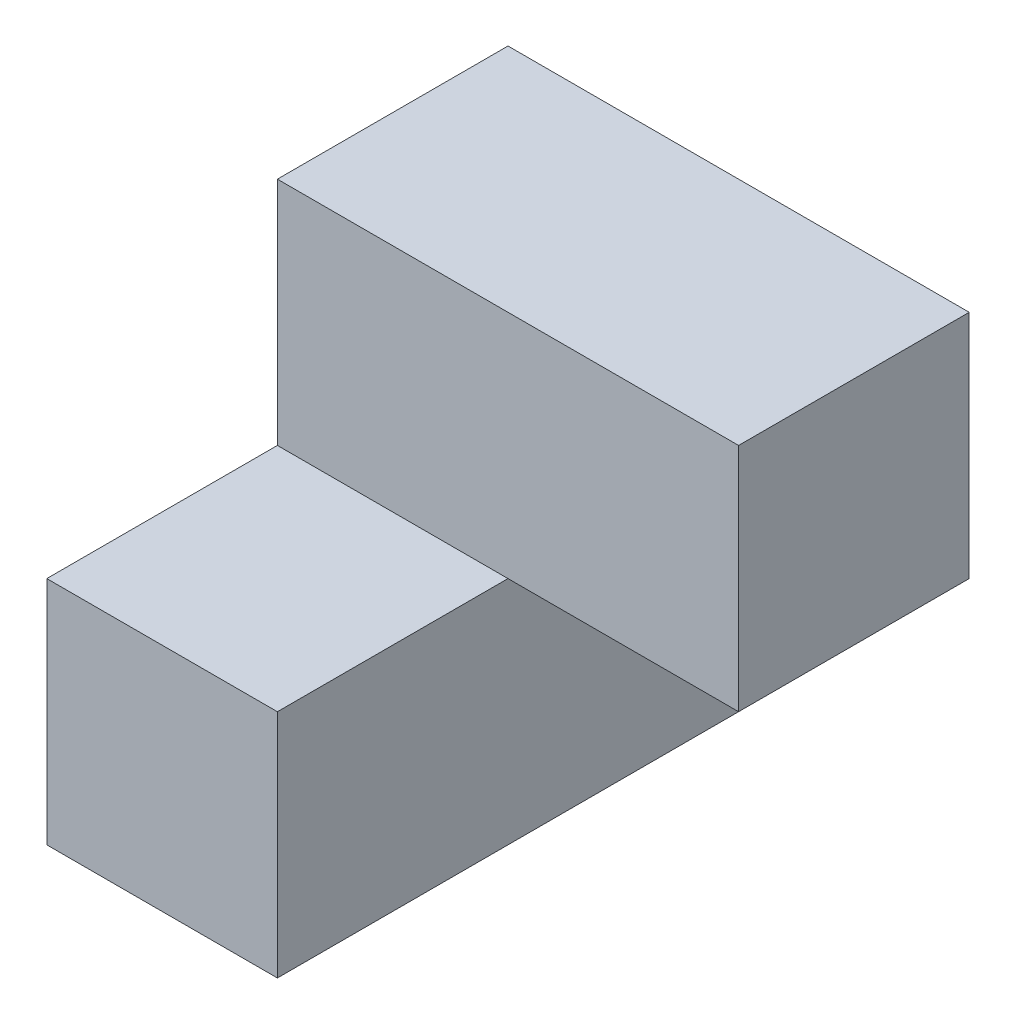
ISO-10303-21;
HEADER;
FILE_DESCRIPTION(('STEP AP214'),'2;1');
FILE_NAME('part.step','',(''),(''),'','','');
FILE_SCHEMA(('AUTOMOTIVE_DESIGN { 1 0 10303 214 1 1 1 1 }'));
ENDSEC;
DATA;
#1=APPLICATION_CONTEXT('core data for automotive mechanical design processes');
#2=APPLICATION_PROTOCOL_DEFINITION('international standard','automotive_design',2000,#1);
#3=PRODUCT_CONTEXT('',#1,'mechanical');
#4=PRODUCT('Part','Part','',(#3));
#5=PRODUCT_RELATED_PRODUCT_CATEGORY('part','',(#4));
#6=PRODUCT_DEFINITION_FORMATION('','',#4);
#7=PRODUCT_DEFINITION_CONTEXT('part definition',#1,'design');
#8=PRODUCT_DEFINITION('design','',#6,#7);
#9=PRODUCT_DEFINITION_SHAPE('','',#8);
#10=(LENGTH_UNIT() NAMED_UNIT(*) SI_UNIT(.MILLI.,.METRE.));
#11=(NAMED_UNIT(*) PLANE_ANGLE_UNIT() SI_UNIT($,.RADIAN.));
#12=(NAMED_UNIT(*) SI_UNIT($,.STERADIAN.) SOLID_ANGLE_UNIT());
#13=UNCERTAINTY_MEASURE_WITH_UNIT(LENGTH_MEASURE(1.E-05),#10,'distance_accuracy_value','');
#14=(GEOMETRIC_REPRESENTATION_CONTEXT(3) GLOBAL_UNCERTAINTY_ASSIGNED_CONTEXT((#13)) GLOBAL_UNIT_ASSIGNED_CONTEXT((#10,
#11,#12)) REPRESENTATION_CONTEXT('',''));
#15=CARTESIAN_POINT('',(0.,0.,0.));
#16=DIRECTION('',(0.,0.,1.));
#17=DIRECTION('',(1.,0.,0.));
#18=AXIS2_PLACEMENT_3D('',#15,#16,#17);
#19=CARTESIAN_POINT('',(25.4,25.4,25.4));
#20=DIRECTION('',(-1.,0.,0.));
#21=DIRECTION('',(0.,0.,1.));
#22=AXIS2_PLACEMENT_3D('',#19,#20,#21);
#23=PLANE('',#22);
#24=DIRECTION('',(0.,1.,0.));
#25=VECTOR('',#24,1.);
#26=CARTESIAN_POINT('',(25.4,-25.401,0.));
#27=LINE('',#26,#25);
#28=CARTESIAN_POINT('',(25.4,0.,0.));
#29=VERTEX_POINT('',#28);
#30=CARTESIAN_POINT('',(25.4,25.4,0.));
#31=VERTEX_POINT('',#30);
#32=EDGE_CURVE('E107',#29,#31,#27,.T.);
#33=ORIENTED_EDGE('',*,*,#32,.F.);
#34=DIRECTION('',(0.,0.,1.));
#35=VECTOR('',#34,1.);
#36=CARTESIAN_POINT('',(25.4,0.,-25.401));
#37=LINE('',#36,#35);
#38=CARTESIAN_POINT('',(25.4,0.,-25.4));
#39=VERTEX_POINT('',#38);
#40=EDGE_CURVE('E47',#39,#29,#37,.T.);
#41=ORIENTED_EDGE('',*,*,#40,.F.);
#42=DIRECTION('',(0.,-1.,0.));
#43=VECTOR('',#42,1.);
#44=CARTESIAN_POINT('',(25.4,25.4,-25.4));
#45=LINE('',#44,#43);
#46=CARTESIAN_POINT('',(25.4,25.4,-25.4));
#47=VERTEX_POINT('',#46);
#48=EDGE_CURVE('E11',#47,#39,#45,.T.);
#49=ORIENTED_EDGE('',*,*,#48,.F.);
#50=DIRECTION('',(0.,0.,-1.));
#51=VECTOR('',#50,1.);
#52=CARTESIAN_POINT('',(25.4,25.4,25.4));
#53=LINE('',#52,#51);
#54=EDGE_CURVE('E96',#31,#47,#53,.T.);
#55=ORIENTED_EDGE('',*,*,#54,.F.);
#56=EDGE_LOOP('',(#33,#41,#49,#55));
#57=FACE_BOUND('',#56,.T.);
#58=ADVANCED_FACE('F33',(#57),#23,.F.);
#59=CARTESIAN_POINT('',(-25.4,25.4,-25.4));
#60=DIRECTION('',(0.,0.,1.));
#61=DIRECTION('',(1.,0.,0.));
#62=AXIS2_PLACEMENT_3D('',#59,#60,#61);
#63=PLANE('',#62);
#64=DIRECTION('',(1.,0.,0.));
#65=VECTOR('',#64,1.);
#66=CARTESIAN_POINT('',(25.4,0.,-25.4));
#67=LINE('',#66,#65);
#68=CARTESIAN_POINT('',(0.,0.,-25.4));
#69=VERTEX_POINT('',#68);
#70=EDGE_CURVE('E126',#69,#39,#67,.T.);
#71=ORIENTED_EDGE('',*,*,#70,.F.);
#72=DIRECTION('',(0.,1.,0.));
#73=VECTOR('',#72,1.);
#74=CARTESIAN_POINT('',(0.,-25.4,-25.4));
#75=LINE('',#74,#73);
#76=CARTESIAN_POINT('',(0.,-25.4,-25.4));
#77=VERTEX_POINT('',#76);
#78=EDGE_CURVE('E134',#77,#69,#75,.T.);
#79=ORIENTED_EDGE('',*,*,#78,.F.);
#80=DIRECTION('',(-1.,0.,0.));
#81=VECTOR('',#80,1.);
#82=CARTESIAN_POINT('',(-25.4,-25.4,-25.4));
#83=LINE('',#82,#81);
#84=CARTESIAN_POINT('',(-25.4,-25.4,-25.4));
#85=VERTEX_POINT('',#84);
#86=EDGE_CURVE('E90',#77,#85,#83,.T.);
#87=ORIENTED_EDGE('',*,*,#86,.T.);
#88=DIRECTION('',(0.,-1.,0.));
#89=VECTOR('',#88,1.);
#90=CARTESIAN_POINT('',(-25.4,25.4,-25.4));
#91=LINE('',#90,#89);
#92=CARTESIAN_POINT('',(-25.4,25.4,-25.4));
#93=VERTEX_POINT('',#92);
#94=EDGE_CURVE('E40',#93,#85,#91,.T.);
#95=ORIENTED_EDGE('',*,*,#94,.F.);
#96=DIRECTION('',(-1.,0.,0.));
#97=VECTOR('',#96,1.);
#98=CARTESIAN_POINT('',(-25.4,25.4,-25.4));
#99=LINE('',#98,#97);
#100=EDGE_CURVE('E56',#47,#93,#99,.T.);
#101=ORIENTED_EDGE('',*,*,#100,.F.);
#102=ORIENTED_EDGE('',*,*,#48,.T.);
#103=EDGE_LOOP('',(#71,#79,#87,#95,#101,#102));
#104=FACE_BOUND('',#103,.T.);
#105=ADVANCED_FACE('F147',(#104),#63,.F.);
#106=CARTESIAN_POINT('',(-25.4,25.4,25.4));
#107=DIRECTION('',(1.,0.,0.));
#108=DIRECTION('',(0.,0.,-1.));
#109=AXIS2_PLACEMENT_3D('',#106,#107,#108);
#110=PLANE('',#109);
#111=DIRECTION('',(0.,0.,1.));
#112=VECTOR('',#111,1.);
#113=CARTESIAN_POINT('',(-25.4,0.,25.4));
#114=LINE('',#113,#112);
#115=CARTESIAN_POINT('',(-25.4,0.,0.));
#116=VERTEX_POINT('',#115);
#117=CARTESIAN_POINT('',(-25.4,0.,25.4));
#118=VERTEX_POINT('',#117);
#119=EDGE_CURVE('E113',#116,#118,#114,.T.);
#120=ORIENTED_EDGE('',*,*,#119,.F.);
#121=DIRECTION('',(0.,-1.,0.));
#122=VECTOR('',#121,1.);
#123=CARTESIAN_POINT('',(-25.4,25.4,0.));
#124=LINE('',#123,#122);
#125=CARTESIAN_POINT('',(-25.4,25.4,0.));
#126=VERTEX_POINT('',#125);
#127=EDGE_CURVE('E123',#126,#116,#124,.T.);
#128=ORIENTED_EDGE('',*,*,#127,.F.);
#129=DIRECTION('',(0.,0.,1.));
#130=VECTOR('',#129,1.);
#131=CARTESIAN_POINT('',(-25.4,25.4,25.4));
#132=LINE('',#131,#130);
#133=EDGE_CURVE('E81',#93,#126,#132,.T.);
#134=ORIENTED_EDGE('',*,*,#133,.F.);
#135=ORIENTED_EDGE('',*,*,#94,.T.);
#136=DIRECTION('',(0.,0.,1.));
#137=VECTOR('',#136,1.);
#138=CARTESIAN_POINT('',(-25.4,-25.4,25.4));
#139=LINE('',#138,#137);
#140=CARTESIAN_POINT('',(-25.4,-25.4,25.4));
#141=VERTEX_POINT('',#140);
#142=EDGE_CURVE('E85',#85,#141,#139,.T.);
#143=ORIENTED_EDGE('',*,*,#142,.T.);
#144=DIRECTION('',(0.,-1.,0.));
#145=VECTOR('',#144,1.);
#146=CARTESIAN_POINT('',(-25.4,25.4,25.4));
#147=LINE('',#146,#145);
#148=EDGE_CURVE('E70',#118,#141,#147,.T.);
#149=ORIENTED_EDGE('',*,*,#148,.F.);
#150=EDGE_LOOP('',(#120,#128,#134,#135,#143,#149));
#151=FACE_BOUND('',#150,.T.);
#152=ADVANCED_FACE('F86',(#151),#110,.F.);
#153=CARTESIAN_POINT('',(-25.4,25.4,25.4));
#154=DIRECTION('',(0.,0.,-1.));
#155=DIRECTION('',(-1.,0.,0.));
#156=AXIS2_PLACEMENT_3D('',#153,#154,#155);
#157=PLANE('',#156);
#158=DIRECTION('',(0.,-1.,0.));
#159=VECTOR('',#158,1.);
#160=CARTESIAN_POINT('',(0.,-25.401,25.4));
#161=LINE('',#160,#159);
#162=CARTESIAN_POINT('',(0.,0.,25.4));
#163=VERTEX_POINT('',#162);
#164=CARTESIAN_POINT('',(0.,-25.4,25.4));
#165=VERTEX_POINT('',#164);
#166=EDGE_CURVE('E110',#163,#165,#161,.T.);
#167=ORIENTED_EDGE('',*,*,#166,.F.);
#168=DIRECTION('',(1.,0.,0.));
#169=VECTOR('',#168,1.);
#170=CARTESIAN_POINT('',(-25.401,0.,25.4));
#171=LINE('',#170,#169);
#172=EDGE_CURVE('E78',#118,#163,#171,.T.);
#173=ORIENTED_EDGE('',*,*,#172,.F.);
#174=ORIENTED_EDGE('',*,*,#148,.T.);
#175=DIRECTION('',(1.,0.,0.));
#176=VECTOR('',#175,1.);
#177=CARTESIAN_POINT('',(-25.4,-25.4,25.4));
#178=LINE('',#177,#176);
#179=EDGE_CURVE('E75',#141,#165,#178,.T.);
#180=ORIENTED_EDGE('',*,*,#179,.T.);
#181=EDGE_LOOP('',(#167,#173,#174,#180));
#182=FACE_BOUND('',#181,.T.);
#183=ADVANCED_FACE('F73',(#182),#157,.F.);
#184=CARTESIAN_POINT('',(0.,25.4,0.));
#185=DIRECTION('',(0.,-1.,0.));
#186=DIRECTION('',(0.,0.,-1.));
#187=AXIS2_PLACEMENT_3D('',#184,#185,#186);
#188=PLANE('',#187);
#189=ORIENTED_EDGE('',*,*,#133,.T.);
#190=DIRECTION('',(-1.,0.,0.));
#191=VECTOR('',#190,1.);
#192=CARTESIAN_POINT('',(50.8,25.4,0.));
#193=LINE('',#192,#191);
#194=EDGE_CURVE('E101',#31,#126,#193,.T.);
#195=ORIENTED_EDGE('',*,*,#194,.F.);
#196=ORIENTED_EDGE('',*,*,#54,.T.);
#197=ORIENTED_EDGE('',*,*,#100,.T.);
#198=EDGE_LOOP('',(#189,#195,#196,#197));
#199=FACE_BOUND('',#198,.T.);
#200=ADVANCED_FACE('F162',(#199),#188,.F.);
#201=CARTESIAN_POINT('',(0.,-25.4,0.));
#202=DIRECTION('',(0.,-1.,0.));
#203=DIRECTION('',(0.,0.,-1.));
#204=AXIS2_PLACEMENT_3D('',#201,#202,#203);
#205=PLANE('',#204);
#206=ORIENTED_EDGE('',*,*,#86,.F.);
#207=DIRECTION('',(0.,0.,1.));
#208=VECTOR('',#207,1.);
#209=CARTESIAN_POINT('',(0.,-25.4,50.8));
#210=LINE('',#209,#208);
#211=EDGE_CURVE('E95',#77,#165,#210,.T.);
#212=ORIENTED_EDGE('',*,*,#211,.T.);
#213=ORIENTED_EDGE('',*,*,#179,.F.);
#214=ORIENTED_EDGE('',*,*,#142,.F.);
#215=EDGE_LOOP('',(#206,#212,#213,#214));
#216=FACE_BOUND('',#215,.T.);
#217=ADVANCED_FACE('F93',(#216),#205,.T.);
#218=CARTESIAN_POINT('',(0.,-25.401,50.8));
#219=DIRECTION('',(-1.,0.,0.));
#220=DIRECTION('',(0.,0.,1.));
#221=AXIS2_PLACEMENT_3D('',#218,#219,#220);
#222=PLANE('',#221);
#223=ORIENTED_EDGE('',*,*,#211,.F.);
#224=ORIENTED_EDGE('',*,*,#78,.T.);
#225=DIRECTION('',(0.,0.,1.));
#226=VECTOR('',#225,1.);
#227=CARTESIAN_POINT('',(0.,0.,-25.401));
#228=LINE('',#227,#226);
#229=CARTESIAN_POINT('',(0.,0.,0.));
#230=VERTEX_POINT('',#229);
#231=EDGE_CURVE('E128',#69,#230,#228,.T.);
#232=ORIENTED_EDGE('',*,*,#231,.T.);
#233=DIRECTION('',(0.,0.,-1.));
#234=VECTOR('',#233,1.);
#235=CARTESIAN_POINT('',(0.,0.,25.4));
#236=LINE('',#235,#234);
#237=EDGE_CURVE('E118',#163,#230,#236,.T.);
#238=ORIENTED_EDGE('',*,*,#237,.F.);
#239=ORIENTED_EDGE('',*,*,#166,.T.);
#240=EDGE_LOOP('',(#223,#224,#232,#238,#239));
#241=FACE_BOUND('',#240,.T.);
#242=ADVANCED_FACE('F140',(#241),#222,.F.);
#243=CARTESIAN_POINT('',(50.8,-25.401,0.));
#244=DIRECTION('',(0.,0.,-1.));
#245=DIRECTION('',(-1.,0.,0.));
#246=AXIS2_PLACEMENT_3D('',#243,#244,#245);
#247=PLANE('',#246);
#248=DIRECTION('',(1.,0.,0.));
#249=VECTOR('',#248,1.);
#250=CARTESIAN_POINT('',(-25.401,0.,0.));
#251=LINE('',#250,#249);
#252=EDGE_CURVE('E116',#116,#230,#251,.T.);
#253=ORIENTED_EDGE('',*,*,#252,.T.);
#254=DIRECTION('',(-1.,0.,0.));
#255=VECTOR('',#254,1.);
#256=CARTESIAN_POINT('',(25.4,0.,0.));
#257=LINE('',#256,#255);
#258=EDGE_CURVE('E130',#29,#230,#257,.T.);
#259=ORIENTED_EDGE('',*,*,#258,.F.);
#260=ORIENTED_EDGE('',*,*,#32,.T.);
#261=ORIENTED_EDGE('',*,*,#194,.T.);
#262=ORIENTED_EDGE('',*,*,#127,.T.);
#263=EDGE_LOOP('',(#253,#259,#260,#261,#262));
#264=FACE_BOUND('',#263,.T.);
#265=ADVANCED_FACE('F158',(#264),#247,.F.);
#266=CARTESIAN_POINT('',(-25.401,0.,25.4));
#267=DIRECTION('',(0.,-1.,0.));
#268=DIRECTION('',(0.,0.,-1.));
#269=AXIS2_PLACEMENT_3D('',#266,#267,#268);
#270=PLANE('',#269);
#271=ORIENTED_EDGE('',*,*,#119,.T.);
#272=ORIENTED_EDGE('',*,*,#172,.T.);
#273=ORIENTED_EDGE('',*,*,#237,.T.);
#274=ORIENTED_EDGE('',*,*,#252,.F.);
#275=EDGE_LOOP('',(#271,#272,#273,#274));
#276=FACE_BOUND('',#275,.T.);
#277=ADVANCED_FACE('F171',(#276),#270,.F.);
#278=CARTESIAN_POINT('',(25.4,0.,-25.401));
#279=DIRECTION('',(0.,1.,0.));
#280=DIRECTION('',(0.,0.,1.));
#281=AXIS2_PLACEMENT_3D('',#278,#279,#280);
#282=PLANE('',#281);
#283=ORIENTED_EDGE('',*,*,#70,.T.);
#284=ORIENTED_EDGE('',*,*,#40,.T.);
#285=ORIENTED_EDGE('',*,*,#258,.T.);
#286=ORIENTED_EDGE('',*,*,#231,.F.);
#287=EDGE_LOOP('',(#283,#284,#285,#286));
#288=FACE_BOUND('',#287,.T.);
#289=ADVANCED_FACE('F150',(#288),#282,.F.);
#290=CLOSED_SHELL('',(#58,#105,#152,#183,#200,#217,#242,#265,#277,#289));
#291=MANIFOLD_SOLID_BREP('B2',#290);
#292=ADVANCED_BREP_SHAPE_REPRESENTATION('',(#18,#291),#14);
#293=SHAPE_DEFINITION_REPRESENTATION(#9,#292);
ENDSEC;
END-ISO-10303-21;
